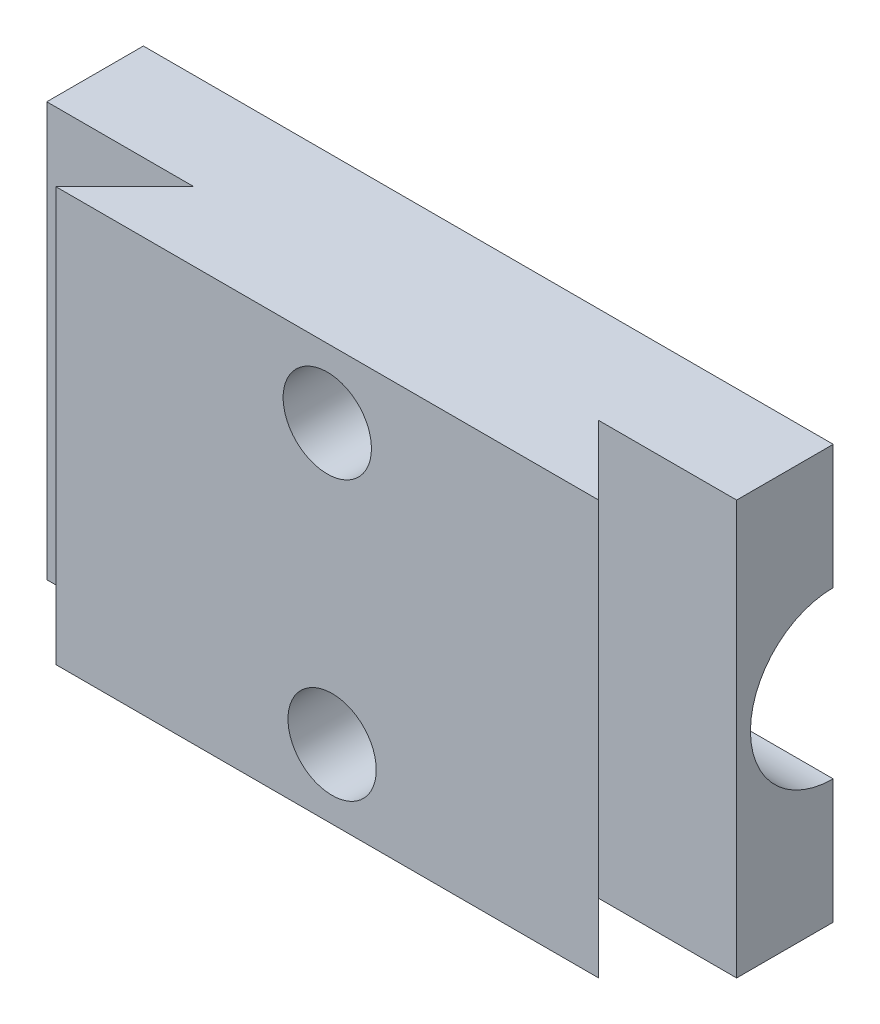
ISO-10303-21;
HEADER;
FILE_DESCRIPTION(('STEP AP214'),'2;1');
FILE_NAME('part.step','',(''),(''),'','','');
FILE_SCHEMA(('AUTOMOTIVE_DESIGN { 1 0 10303 214 1 1 1 1 }'));
ENDSEC;
DATA;
#1=APPLICATION_CONTEXT('core data for automotive mechanical design processes');
#2=APPLICATION_PROTOCOL_DEFINITION('international standard','automotive_design',2000,#1);
#3=PRODUCT_CONTEXT('',#1,'mechanical');
#4=PRODUCT('Part','Part','',(#3));
#5=PRODUCT_RELATED_PRODUCT_CATEGORY('part','',(#4));
#6=PRODUCT_DEFINITION_FORMATION('','',#4);
#7=PRODUCT_DEFINITION_CONTEXT('part definition',#1,'design');
#8=PRODUCT_DEFINITION('design','',#6,#7);
#9=PRODUCT_DEFINITION_SHAPE('','',#8);
#10=(LENGTH_UNIT() NAMED_UNIT(*) SI_UNIT(.MILLI.,.METRE.));
#11=(NAMED_UNIT(*) PLANE_ANGLE_UNIT() SI_UNIT($,.RADIAN.));
#12=(NAMED_UNIT(*) SI_UNIT($,.STERADIAN.) SOLID_ANGLE_UNIT());
#13=UNCERTAINTY_MEASURE_WITH_UNIT(LENGTH_MEASURE(1.E-05),#10,'distance_accuracy_value','');
#14=(GEOMETRIC_REPRESENTATION_CONTEXT(3) GLOBAL_UNCERTAINTY_ASSIGNED_CONTEXT((#13)) GLOBAL_UNIT_ASSIGNED_CONTEXT((#10,
#11,#12)) REPRESENTATION_CONTEXT('',''));
#15=CARTESIAN_POINT('',(0.,0.,0.));
#16=DIRECTION('',(0.,0.,1.));
#17=DIRECTION('',(1.,0.,0.));
#18=AXIS2_PLACEMENT_3D('',#15,#16,#17);
#19=CARTESIAN_POINT('',(25.6799439244036,5.,-7.));
#20=DIRECTION('',(0.,0.,1.));
#21=DIRECTION('',(1.,0.,0.));
#22=AXIS2_PLACEMENT_3D('',#19,#20,#21);
#23=CYLINDRICAL_SURFACE('',#22,1.5);
#24=CARTESIAN_POINT('',(25.6799439244036,5.,-7.));
#25=DIRECTION('',(0.,0.,1.));
#26=DIRECTION('',(1.,0.,0.));
#27=AXIS2_PLACEMENT_3D('',#24,#25,#26);
#28=CIRCLE('',#27,1.5);
#29=CARTESIAN_POINT('',(27.1799439244036,5.,-7.));
#30=VERTEX_POINT('',#29);
#31=EDGE_CURVE('E189',#30,#30,#28,.T.);
#32=ORIENTED_EDGE('',*,*,#31,.F.);
#33=EDGE_LOOP('',(#32));
#34=FACE_BOUND('',#33,.T.);
#35=CARTESIAN_POINT('',(25.6799439244036,5.,0.));
#36=DIRECTION('',(0.,0.,1.));
#37=DIRECTION('',(1.,0.,0.));
#38=AXIS2_PLACEMENT_3D('',#35,#36,#37);
#39=CIRCLE('',#38,1.5);
#40=CARTESIAN_POINT('',(27.1799439244036,5.,0.));
#41=VERTEX_POINT('',#40);
#42=EDGE_CURVE('E38',#41,#41,#39,.F.);
#43=ORIENTED_EDGE('',*,*,#42,.F.);
#44=EDGE_LOOP('',(#43));
#45=FACE_BOUND('',#44,.T.);
#46=ADVANCED_FACE('F34',(#34,#45),#23,.F.);
#47=CARTESIAN_POINT('',(25.3311335505265,25.,-7.));
#48=DIRECTION('',(0.,0.,1.));
#49=DIRECTION('',(1.,0.,0.));
#50=AXIS2_PLACEMENT_3D('',#47,#48,#49);
#51=CYLINDRICAL_SURFACE('',#50,1.5);
#52=CARTESIAN_POINT('',(25.3311335505265,25.,-7.));
#53=DIRECTION('',(0.,0.,1.));
#54=DIRECTION('',(1.,0.,0.));
#55=AXIS2_PLACEMENT_3D('',#52,#53,#54);
#56=CIRCLE('',#55,1.5);
#57=CARTESIAN_POINT('',(26.8311335505265,25.,-7.));
#58=VERTEX_POINT('',#57);
#59=EDGE_CURVE('E117',#58,#58,#56,.T.);
#60=ORIENTED_EDGE('',*,*,#59,.F.);
#61=EDGE_LOOP('',(#60));
#62=FACE_BOUND('',#61,.T.);
#63=CARTESIAN_POINT('',(25.3311335505265,25.,0.));
#64=DIRECTION('',(0.,0.,1.));
#65=DIRECTION('',(1.,0.,0.));
#66=AXIS2_PLACEMENT_3D('',#63,#64,#65);
#67=CIRCLE('',#66,1.5);
#68=CARTESIAN_POINT('',(26.8311335505265,25.,0.));
#69=VERTEX_POINT('',#68);
#70=EDGE_CURVE('E187',#69,#69,#67,.F.);
#71=ORIENTED_EDGE('',*,*,#70,.F.);
#72=EDGE_LOOP('',(#71));
#73=FACE_BOUND('',#72,.T.);
#74=ADVANCED_FACE('F249',(#62,#73),#51,.F.);
#75=CARTESIAN_POINT('',(0.,0.,-7.));
#76=DIRECTION('',(0.,0.,1.));
#77=DIRECTION('',(1.,0.,0.));
#78=AXIS2_PLACEMENT_3D('',#75,#76,#77);
#79=PLANE('',#78);
#80=ORIENTED_EDGE('',*,*,#59,.T.);
#81=EDGE_LOOP('',(#80));
#82=FACE_BOUND('',#81,.T.);
#83=DIRECTION('',(0.,-1.,0.));
#84=VECTOR('',#83,1.);
#85=CARTESIAN_POINT('',(50.,0.,-7.));
#86=LINE('',#85,#84);
#87=CARTESIAN_POINT('',(50.,30.,-7.));
#88=VERTEX_POINT('',#87);
#89=CARTESIAN_POINT('',(50.,21.,-7.));
#90=VERTEX_POINT('',#89);
#91=EDGE_CURVE('E126',#88,#90,#86,.T.);
#92=ORIENTED_EDGE('',*,*,#91,.T.);
#93=DIRECTION('',(-1.,0.,0.));
#94=VECTOR('',#93,1.);
#95=CARTESIAN_POINT('',(50.,21.,-7.));
#96=LINE('',#95,#94);
#97=CARTESIAN_POINT('',(0.,21.,-7.));
#98=VERTEX_POINT('',#97);
#99=EDGE_CURVE('E11',#90,#98,#96,.T.);
#100=ORIENTED_EDGE('',*,*,#99,.T.);
#101=DIRECTION('',(0.,1.,0.));
#102=VECTOR('',#101,1.);
#103=CARTESIAN_POINT('',(0.,0.,-7.));
#104=LINE('',#103,#102);
#105=CARTESIAN_POINT('',(0.,30.,-7.));
#106=VERTEX_POINT('',#105);
#107=EDGE_CURVE('E123',#98,#106,#104,.T.);
#108=ORIENTED_EDGE('',*,*,#107,.T.);
#109=DIRECTION('',(1.,0.,0.));
#110=VECTOR('',#109,1.);
#111=CARTESIAN_POINT('',(50.,30.,-7.));
#112=LINE('',#111,#110);
#113=EDGE_CURVE('E135',#106,#88,#112,.T.);
#114=ORIENTED_EDGE('',*,*,#113,.T.);
#115=EDGE_LOOP('',(#92,#100,#108,#114));
#116=FACE_BOUND('',#115,.T.);
#117=ADVANCED_FACE('F121',(#82,#116),#79,.F.);
#118=CARTESIAN_POINT('',(50.,30.,5.));
#119=DIRECTION('',(0.,-1.,0.));
#120=DIRECTION('',(1.,0.,0.));
#121=AXIS2_PLACEMENT_3D('',#118,#119,#120);
#122=PLANE('',#121);
#123=DIRECTION('',(0.707106781186543,0.,0.707106781186552));
#124=VECTOR('',#123,1.);
#125=CARTESIAN_POINT('',(20.0000000000002,30.,-20.));
#126=LINE('',#125,#124);
#127=CARTESIAN_POINT('',(40.,30.,0.));
#128=VERTEX_POINT('',#127);
#129=CARTESIAN_POINT('',(44.9999999999999,30.,5.));
#130=VERTEX_POINT('',#129);
#131=EDGE_CURVE('E144',#128,#130,#126,.T.);
#132=ORIENTED_EDGE('',*,*,#131,.F.);
#133=DIRECTION('',(-1.,0.,0.));
#134=VECTOR('',#133,1.);
#135=CARTESIAN_POINT('',(0.,30.,0.));
#136=LINE('',#135,#134);
#137=CARTESIAN_POINT('',(50.,30.,0.));
#138=VERTEX_POINT('',#137);
#139=EDGE_CURVE('E141',#138,#128,#136,.T.);
#140=ORIENTED_EDGE('',*,*,#139,.F.);
#141=DIRECTION('',(0.,0.,-1.));
#142=VECTOR('',#141,1.);
#143=CARTESIAN_POINT('',(50.,30.,5.));
#144=LINE('',#143,#142);
#145=EDGE_CURVE('E185',#138,#88,#144,.T.);
#146=ORIENTED_EDGE('',*,*,#145,.T.);
#147=ORIENTED_EDGE('',*,*,#113,.F.);
#148=DIRECTION('',(0.,0.,-1.));
#149=VECTOR('',#148,1.);
#150=CARTESIAN_POINT('',(0.,30.,5.));
#151=LINE('',#150,#149);
#152=CARTESIAN_POINT('',(0.,30.,0.));
#153=VERTEX_POINT('',#152);
#154=EDGE_CURVE('E130',#153,#106,#151,.T.);
#155=ORIENTED_EDGE('',*,*,#154,.F.);
#156=DIRECTION('',(1.,0.,0.));
#157=VECTOR('',#156,1.);
#158=CARTESIAN_POINT('',(0.,30.,0.));
#159=LINE('',#158,#157);
#160=CARTESIAN_POINT('',(10.6622671010531,30.,0.));
#161=VERTEX_POINT('',#160);
#162=EDGE_CURVE('E161',#153,#161,#159,.T.);
#163=ORIENTED_EDGE('',*,*,#162,.T.);
#164=DIRECTION('',(-0.707106781186551,0.,0.707106781186544));
#165=VECTOR('',#164,1.);
#166=CARTESIAN_POINT('',(5.33113355052651,30.,5.33113355052657));
#167=LINE('',#166,#165);
#168=CARTESIAN_POINT('',(5.66226710105308,30.,5.));
#169=VERTEX_POINT('',#168);
#170=EDGE_CURVE('E153',#161,#169,#167,.T.);
#171=ORIENTED_EDGE('',*,*,#170,.T.);
#172=DIRECTION('',(-1.,0.,0.));
#173=VECTOR('',#172,1.);
#174=CARTESIAN_POINT('',(50.,30.,5.));
#175=LINE('',#174,#173);
#176=EDGE_CURVE('E171',#130,#169,#175,.T.);
#177=ORIENTED_EDGE('',*,*,#176,.F.);
#178=EDGE_LOOP('',(#132,#140,#146,#147,#155,#163,#171,#177));
#179=FACE_BOUND('',#178,.T.);
#180=ADVANCED_FACE('F224',(#179),#122,.F.);
#181=CARTESIAN_POINT('',(0.,0.,5.));
#182=DIRECTION('',(1.,0.,0.));
#183=DIRECTION('',(0.,0.,-1.));
#184=AXIS2_PLACEMENT_3D('',#181,#182,#183);
#185=PLANE('',#184);
#186=ORIENTED_EDGE('',*,*,#107,.F.);
#187=CARTESIAN_POINT('',(0.,15.,-7.));
#188=DIRECTION('',(-1.,0.,0.));
#189=DIRECTION('',(0.,0.,1.));
#190=AXIS2_PLACEMENT_3D('',#187,#188,#189);
#191=CIRCLE('',#190,6.);
#192=CARTESIAN_POINT('',(0.,8.99999999999999,-7.));
#193=VERTEX_POINT('',#192);
#194=EDGE_CURVE('E111',#193,#98,#191,.T.);
#195=ORIENTED_EDGE('',*,*,#194,.F.);
#196=CARTESIAN_POINT('',(0.,0.,-7.));
#197=VERTEX_POINT('',#196);
#198=EDGE_CURVE('E132',#197,#193,#104,.T.);
#199=ORIENTED_EDGE('',*,*,#198,.F.);
#200=DIRECTION('',(0.,0.,-1.));
#201=VECTOR('',#200,1.);
#202=CARTESIAN_POINT('',(0.,0.,5.));
#203=LINE('',#202,#201);
#204=CARTESIAN_POINT('',(0.,0.,0.));
#205=VERTEX_POINT('',#204);
#206=EDGE_CURVE('E182',#205,#197,#203,.T.);
#207=ORIENTED_EDGE('',*,*,#206,.F.);
#208=DIRECTION('',(0.,1.,0.));
#209=VECTOR('',#208,1.);
#210=CARTESIAN_POINT('',(0.,0.,0.));
#211=LINE('',#210,#209);
#212=EDGE_CURVE('E172',#205,#153,#211,.T.);
#213=ORIENTED_EDGE('',*,*,#212,.T.);
#214=ORIENTED_EDGE('',*,*,#154,.T.);
#215=EDGE_LOOP('',(#186,#195,#199,#207,#213,#214));
#216=FACE_BOUND('',#215,.T.);
#217=ADVANCED_FACE('F127',(#216),#185,.F.);
#218=CARTESIAN_POINT('',(50.,0.,5.));
#219=DIRECTION('',(0.,1.,0.));
#220=DIRECTION('',(0.,0.,1.));
#221=AXIS2_PLACEMENT_3D('',#218,#219,#220);
#222=PLANE('',#221);
#223=DIRECTION('',(0.,0.,-1.));
#224=VECTOR('',#223,1.);
#225=CARTESIAN_POINT('',(50.,0.,5.));
#226=LINE('',#225,#224);
#227=CARTESIAN_POINT('',(50.,0.,0.));
#228=VERTEX_POINT('',#227);
#229=CARTESIAN_POINT('',(50.,0.,-7.));
#230=VERTEX_POINT('',#229);
#231=EDGE_CURVE('E179',#228,#230,#226,.T.);
#232=ORIENTED_EDGE('',*,*,#231,.F.);
#233=DIRECTION('',(-1.,0.,0.));
#234=VECTOR('',#233,1.);
#235=CARTESIAN_POINT('',(0.,0.,0.));
#236=LINE('',#235,#234);
#237=CARTESIAN_POINT('',(40.,0.,0.));
#238=VERTEX_POINT('',#237);
#239=EDGE_CURVE('E59',#228,#238,#236,.T.);
#240=ORIENTED_EDGE('',*,*,#239,.T.);
#241=DIRECTION('',(0.707106781186543,0.,0.707106781186552));
#242=VECTOR('',#241,1.);
#243=CARTESIAN_POINT('',(20.0000000000002,0.,-20.));
#244=LINE('',#243,#242);
#245=CARTESIAN_POINT('',(44.9999999999999,0.,5.));
#246=VERTEX_POINT('',#245);
#247=EDGE_CURVE('E143',#238,#246,#244,.T.);
#248=ORIENTED_EDGE('',*,*,#247,.T.);
#249=DIRECTION('',(1.,0.,0.));
#250=VECTOR('',#249,1.);
#251=CARTESIAN_POINT('',(50.,0.,5.));
#252=LINE('',#251,#250);
#253=CARTESIAN_POINT('',(5.66226710105309,0.,5.));
#254=VERTEX_POINT('',#253);
#255=EDGE_CURVE('E176',#254,#246,#252,.T.);
#256=ORIENTED_EDGE('',*,*,#255,.F.);
#257=DIRECTION('',(-0.707106781186551,0.,0.707106781186544));
#258=VECTOR('',#257,1.);
#259=CARTESIAN_POINT('',(5.33113355052652,0.,5.33113355052657));
#260=LINE('',#259,#258);
#261=CARTESIAN_POINT('',(10.6622671010531,0.,0.));
#262=VERTEX_POINT('',#261);
#263=EDGE_CURVE('E158',#262,#254,#260,.T.);
#264=ORIENTED_EDGE('',*,*,#263,.F.);
#265=DIRECTION('',(1.,0.,0.));
#266=VECTOR('',#265,1.);
#267=CARTESIAN_POINT('',(0.,0.,0.));
#268=LINE('',#267,#266);
#269=EDGE_CURVE('E160',#205,#262,#268,.T.);
#270=ORIENTED_EDGE('',*,*,#269,.F.);
#271=ORIENTED_EDGE('',*,*,#206,.T.);
#272=DIRECTION('',(-1.,0.,0.));
#273=VECTOR('',#272,1.);
#274=CARTESIAN_POINT('',(50.,0.,-7.));
#275=LINE('',#274,#273);
#276=EDGE_CURVE('E133',#230,#197,#275,.T.);
#277=ORIENTED_EDGE('',*,*,#276,.F.);
#278=EDGE_LOOP('',(#232,#240,#248,#256,#264,#270,#271,#277));
#279=FACE_BOUND('',#278,.T.);
#280=ADVANCED_FACE('F217',(#279),#222,.F.);
#281=CARTESIAN_POINT('',(0.,0.,5.));
#282=DIRECTION('',(0.,0.,1.));
#283=DIRECTION('',(1.,0.,0.));
#284=AXIS2_PLACEMENT_3D('',#281,#282,#283);
#285=PLANE('',#284);
#286=CARTESIAN_POINT('',(25.6799439244036,5.,5.));
#287=DIRECTION('',(0.,0.,1.));
#288=DIRECTION('',(1.,0.,0.));
#289=AXIS2_PLACEMENT_3D('',#286,#287,#288);
#290=CIRCLE('',#289,3.2);
#291=CARTESIAN_POINT('',(28.8799439244036,5.,5.));
#292=VERTEX_POINT('',#291);
#293=EDGE_CURVE('E407',#292,#292,#290,.T.);
#294=ORIENTED_EDGE('',*,*,#293,.F.);
#295=EDGE_LOOP('',(#294));
#296=FACE_BOUND('',#295,.T.);
#297=CARTESIAN_POINT('',(25.3311335505265,25.,5.));
#298=DIRECTION('',(0.,0.,1.));
#299=DIRECTION('',(1.,0.,0.));
#300=AXIS2_PLACEMENT_3D('',#297,#298,#299);
#301=CIRCLE('',#300,3.2);
#302=CARTESIAN_POINT('',(28.5311335505265,25.,5.));
#303=VERTEX_POINT('',#302);
#304=EDGE_CURVE('E196',#303,#303,#301,.T.);
#305=ORIENTED_EDGE('',*,*,#304,.F.);
#306=EDGE_LOOP('',(#305));
#307=FACE_BOUND('',#306,.T.);
#308=DIRECTION('',(0.,1.,0.));
#309=VECTOR('',#308,1.);
#310=CARTESIAN_POINT('',(44.9999999999999,0.,5.));
#311=LINE('',#310,#309);
#312=EDGE_CURVE('E154',#246,#130,#311,.T.);
#313=ORIENTED_EDGE('',*,*,#312,.T.);
#314=ORIENTED_EDGE('',*,*,#176,.T.);
#315=DIRECTION('',(0.,1.,0.));
#316=VECTOR('',#315,1.);
#317=CARTESIAN_POINT('',(5.66226710105309,0.,5.));
#318=LINE('',#317,#316);
#319=EDGE_CURVE('E168',#254,#169,#318,.T.);
#320=ORIENTED_EDGE('',*,*,#319,.F.);
#321=ORIENTED_EDGE('',*,*,#255,.T.);
#322=EDGE_LOOP('',(#313,#314,#320,#321));
#323=FACE_BOUND('',#322,.T.);
#324=ADVANCED_FACE('F234',(#296,#307,#323),#285,.T.);
#325=CARTESIAN_POINT('',(50.,0.,5.));
#326=DIRECTION('',(-1.,0.,0.));
#327=DIRECTION('',(0.,0.,1.));
#328=AXIS2_PLACEMENT_3D('',#325,#326,#327);
#329=PLANE('',#328);
#330=CARTESIAN_POINT('',(50.,8.99999999999999,-7.));
#331=VERTEX_POINT('',#330);
#332=EDGE_CURVE('E208',#331,#230,#86,.T.);
#333=ORIENTED_EDGE('',*,*,#332,.F.);
#334=CARTESIAN_POINT('',(50.,15.,-7.));
#335=DIRECTION('',(-1.,0.,0.));
#336=DIRECTION('',(0.,0.,1.));
#337=AXIS2_PLACEMENT_3D('',#334,#335,#336);
#338=CIRCLE('',#337,6.);
#339=EDGE_CURVE('E51',#331,#90,#338,.T.);
#340=ORIENTED_EDGE('',*,*,#339,.T.);
#341=ORIENTED_EDGE('',*,*,#91,.F.);
#342=ORIENTED_EDGE('',*,*,#145,.F.);
#343=DIRECTION('',(0.,1.,0.));
#344=VECTOR('',#343,1.);
#345=CARTESIAN_POINT('',(50.,0.,0.));
#346=LINE('',#345,#344);
#347=EDGE_CURVE('E151',#228,#138,#346,.T.);
#348=ORIENTED_EDGE('',*,*,#347,.F.);
#349=ORIENTED_EDGE('',*,*,#231,.T.);
#350=EDGE_LOOP('',(#333,#340,#341,#342,#348,#349));
#351=FACE_BOUND('',#350,.T.);
#352=ADVANCED_FACE('F36',(#351),#329,.F.);
#353=CARTESIAN_POINT('',(5.33113355052652,0.,5.33113355052657));
#354=DIRECTION('',(-0.707106781186544,0.,-0.707106781186551));
#355=DIRECTION('',(-0.707106781186551,0.,0.707106781186544));
#356=AXIS2_PLACEMENT_3D('',#353,#354,#355);
#357=PLANE('',#356);
#358=ORIENTED_EDGE('',*,*,#170,.F.);
#359=DIRECTION('',(0.,1.,0.));
#360=VECTOR('',#359,1.);
#361=CARTESIAN_POINT('',(10.6622671010531,0.,0.));
#362=LINE('',#361,#360);
#363=EDGE_CURVE('E163',#262,#161,#362,.T.);
#364=ORIENTED_EDGE('',*,*,#363,.F.);
#365=ORIENTED_EDGE('',*,*,#263,.T.);
#366=ORIENTED_EDGE('',*,*,#319,.T.);
#367=EDGE_LOOP('',(#358,#364,#365,#366));
#368=FACE_BOUND('',#367,.T.);
#369=ADVANCED_FACE('F237',(#368),#357,.T.);
#370=CARTESIAN_POINT('',(0.,0.,0.));
#371=DIRECTION('',(0.,0.,1.));
#372=DIRECTION('',(1.,0.,0.));
#373=AXIS2_PLACEMENT_3D('',#370,#371,#372);
#374=PLANE('',#373);
#375=ORIENTED_EDGE('',*,*,#162,.F.);
#376=ORIENTED_EDGE('',*,*,#212,.F.);
#377=ORIENTED_EDGE('',*,*,#269,.T.);
#378=ORIENTED_EDGE('',*,*,#363,.T.);
#379=EDGE_LOOP('',(#375,#376,#377,#378));
#380=FACE_BOUND('',#379,.T.);
#381=ADVANCED_FACE('F239',(#380),#374,.T.);
#382=CARTESIAN_POINT('',(0.,0.,0.));
#383=DIRECTION('',(0.,0.,-1.));
#384=DIRECTION('',(-1.,0.,0.));
#385=AXIS2_PLACEMENT_3D('',#382,#383,#384);
#386=PLANE('',#385);
#387=ORIENTED_EDGE('',*,*,#139,.T.);
#388=DIRECTION('',(0.,1.,0.));
#389=VECTOR('',#388,1.);
#390=CARTESIAN_POINT('',(40.,0.,0.));
#391=LINE('',#390,#389);
#392=EDGE_CURVE('E147',#238,#128,#391,.T.);
#393=ORIENTED_EDGE('',*,*,#392,.F.);
#394=ORIENTED_EDGE('',*,*,#239,.F.);
#395=ORIENTED_EDGE('',*,*,#347,.T.);
#396=EDGE_LOOP('',(#387,#393,#394,#395));
#397=FACE_BOUND('',#396,.T.);
#398=ADVANCED_FACE('F227',(#397),#386,.F.);
#399=CARTESIAN_POINT('',(20.0000000000002,0.,-20.));
#400=DIRECTION('',(-0.707106781186552,0.,0.707106781186543));
#401=DIRECTION('',(0.707106781186543,0.,0.707106781186552));
#402=AXIS2_PLACEMENT_3D('',#399,#400,#401);
#403=PLANE('',#402);
#404=ORIENTED_EDGE('',*,*,#131,.T.);
#405=ORIENTED_EDGE('',*,*,#312,.F.);
#406=ORIENTED_EDGE('',*,*,#247,.F.);
#407=ORIENTED_EDGE('',*,*,#392,.T.);
#408=EDGE_LOOP('',(#404,#405,#406,#407));
#409=FACE_BOUND('',#408,.T.);
#410=ADVANCED_FACE('F230',(#409),#403,.F.);
#411=ORIENTED_EDGE('',*,*,#31,.T.);
#412=EDGE_LOOP('',(#411));
#413=FACE_BOUND('',#412,.T.);
#414=ORIENTED_EDGE('',*,*,#198,.T.);
#415=DIRECTION('',(-1.,0.,0.));
#416=VECTOR('',#415,1.);
#417=CARTESIAN_POINT('',(50.,8.99999999999999,-7.));
#418=LINE('',#417,#416);
#419=EDGE_CURVE('E43',#193,#331,#418,.F.);
#420=ORIENTED_EDGE('',*,*,#419,.T.);
#421=ORIENTED_EDGE('',*,*,#332,.T.);
#422=ORIENTED_EDGE('',*,*,#276,.T.);
#423=EDGE_LOOP('',(#414,#420,#421,#422));
#424=FACE_BOUND('',#423,.T.);
#425=ADVANCED_FACE('F211',(#413,#424),#79,.F.);
#426=CARTESIAN_POINT('',(50.,15.,-7.));
#427=DIRECTION('',(-1.,0.,0.));
#428=DIRECTION('',(0.,0.,1.));
#429=AXIS2_PLACEMENT_3D('',#426,#427,#428);
#430=CYLINDRICAL_SURFACE('',#429,6.);
#431=ORIENTED_EDGE('',*,*,#339,.F.);
#432=ORIENTED_EDGE('',*,*,#419,.F.);
#433=ORIENTED_EDGE('',*,*,#194,.T.);
#434=ORIENTED_EDGE('',*,*,#99,.F.);
#435=EDGE_LOOP('',(#431,#432,#433,#434));
#436=FACE_BOUND('',#435,.T.);
#437=ADVANCED_FACE('F112',(#436),#430,.F.);
#438=CARTESIAN_POINT('',(25.3311335505265,25.,0.));
#439=DIRECTION('',(0.,0.,1.));
#440=DIRECTION('',(1.,0.,0.));
#441=AXIS2_PLACEMENT_3D('',#438,#439,#440);
#442=PLANE('',#441);
#443=CARTESIAN_POINT('',(25.3311335505265,25.,0.));
#444=DIRECTION('',(0.,0.,1.));
#445=DIRECTION('',(1.,0.,0.));
#446=AXIS2_PLACEMENT_3D('',#443,#444,#445);
#447=CIRCLE('',#446,3.2);
#448=CARTESIAN_POINT('',(28.5311335505265,25.,0.));
#449=VERTEX_POINT('',#448);
#450=EDGE_CURVE('E190',#449,#449,#447,.T.);
#451=ORIENTED_EDGE('',*,*,#450,.T.);
#452=EDGE_LOOP('',(#451));
#453=FACE_BOUND('',#452,.T.);
#454=ORIENTED_EDGE('',*,*,#70,.T.);
#455=EDGE_LOOP('',(#454));
#456=FACE_BOUND('',#455,.T.);
#457=ADVANCED_FACE('F265',(#453,#456),#442,.T.);
#458=CARTESIAN_POINT('',(25.3311335505265,25.,0.));
#459=DIRECTION('',(0.,0.,1.));
#460=DIRECTION('',(1.,0.,0.));
#461=AXIS2_PLACEMENT_3D('',#458,#459,#460);
#462=CYLINDRICAL_SURFACE('',#461,3.2);
#463=ORIENTED_EDGE('',*,*,#450,.F.);
#464=EDGE_LOOP('',(#463));
#465=FACE_BOUND('',#464,.T.);
#466=ORIENTED_EDGE('',*,*,#304,.T.);
#467=EDGE_LOOP('',(#466));
#468=FACE_BOUND('',#467,.T.);
#469=ADVANCED_FACE('F261',(#465,#468),#462,.F.);
#470=CARTESIAN_POINT('',(25.6799439244036,5.,0.));
#471=DIRECTION('',(0.,0.,1.));
#472=DIRECTION('',(1.,0.,0.));
#473=AXIS2_PLACEMENT_3D('',#470,#471,#472);
#474=PLANE('',#473);
#475=CARTESIAN_POINT('',(25.6799439244036,5.,0.));
#476=DIRECTION('',(0.,0.,1.));
#477=DIRECTION('',(1.,0.,0.));
#478=AXIS2_PLACEMENT_3D('',#475,#476,#477);
#479=CIRCLE('',#478,3.2);
#480=CARTESIAN_POINT('',(28.8799439244036,5.,0.));
#481=VERTEX_POINT('',#480);
#482=EDGE_CURVE('E203',#481,#481,#479,.T.);
#483=ORIENTED_EDGE('',*,*,#482,.T.);
#484=EDGE_LOOP('',(#483));
#485=FACE_BOUND('',#484,.T.);
#486=ORIENTED_EDGE('',*,*,#42,.T.);
#487=EDGE_LOOP('',(#486));
#488=FACE_BOUND('',#487,.T.);
#489=ADVANCED_FACE('F379',(#485,#488),#474,.T.);
#490=CARTESIAN_POINT('',(25.6799439244036,5.,0.));
#491=DIRECTION('',(0.,0.,1.));
#492=DIRECTION('',(1.,0.,0.));
#493=AXIS2_PLACEMENT_3D('',#490,#491,#492);
#494=CYLINDRICAL_SURFACE('',#493,3.2);
#495=ORIENTED_EDGE('',*,*,#482,.F.);
#496=EDGE_LOOP('',(#495));
#497=FACE_BOUND('',#496,.T.);
#498=ORIENTED_EDGE('',*,*,#293,.T.);
#499=EDGE_LOOP('',(#498));
#500=FACE_BOUND('',#499,.T.);
#501=ADVANCED_FACE('F388',(#497,#500),#494,.F.);
#502=CLOSED_SHELL('',(#46,#74,#117,#180,#217,#280,#324,#352,#369,#381,#398,#410,#425,#437,#457,
#469,#489,#501));
#503=MANIFOLD_SOLID_BREP('B2',#502);
#504=ADVANCED_BREP_SHAPE_REPRESENTATION('',(#18,#503),#14);
#505=SHAPE_DEFINITION_REPRESENTATION(#9,#504);
ENDSEC;
END-ISO-10303-21;
